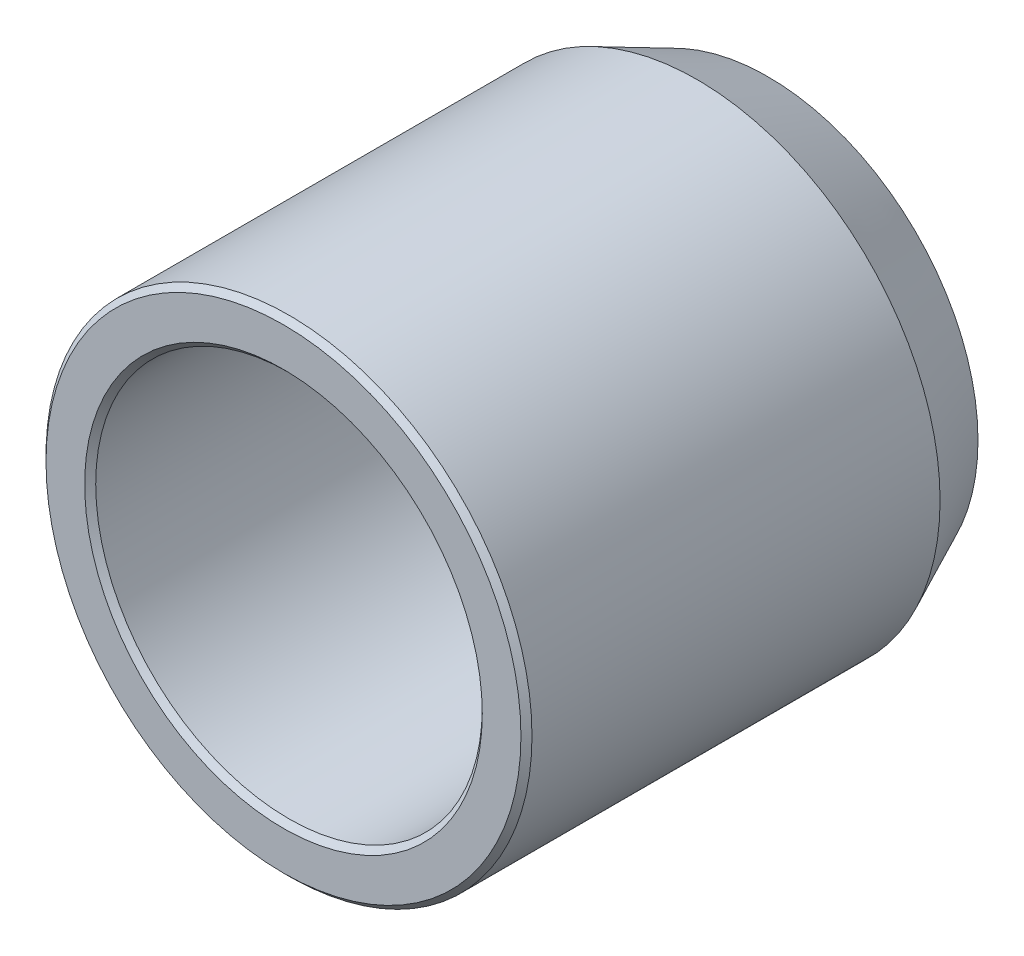
ISO-10303-21;
HEADER;
FILE_DESCRIPTION(('STEP AP214'),'2;1');
FILE_NAME('part.step','',(''),(''),'','','');
FILE_SCHEMA(('AUTOMOTIVE_DESIGN { 1 0 10303 214 1 1 1 1 }'));
ENDSEC;
DATA;
#1=APPLICATION_CONTEXT('core data for automotive mechanical design processes');
#2=APPLICATION_PROTOCOL_DEFINITION('international standard','automotive_design',2000,#1);
#3=PRODUCT_CONTEXT('',#1,'mechanical');
#4=PRODUCT('Part','Part','',(#3));
#5=PRODUCT_RELATED_PRODUCT_CATEGORY('part','',(#4));
#6=PRODUCT_DEFINITION_FORMATION('','',#4);
#7=PRODUCT_DEFINITION_CONTEXT('part definition',#1,'design');
#8=PRODUCT_DEFINITION('design','',#6,#7);
#9=PRODUCT_DEFINITION_SHAPE('','',#8);
#10=(LENGTH_UNIT() NAMED_UNIT(*) SI_UNIT(.MILLI.,.METRE.));
#11=(NAMED_UNIT(*) PLANE_ANGLE_UNIT() SI_UNIT($,.RADIAN.));
#12=(NAMED_UNIT(*) SI_UNIT($,.STERADIAN.) SOLID_ANGLE_UNIT());
#13=UNCERTAINTY_MEASURE_WITH_UNIT(LENGTH_MEASURE(1.E-05),#10,'distance_accuracy_value','');
#14=(GEOMETRIC_REPRESENTATION_CONTEXT(3) GLOBAL_UNCERTAINTY_ASSIGNED_CONTEXT((#13)) GLOBAL_UNIT_ASSIGNED_CONTEXT((#10,
#11,#12)) REPRESENTATION_CONTEXT('',''));
#15=CARTESIAN_POINT('',(0.,0.,0.));
#16=DIRECTION('',(0.,0.,1.));
#17=DIRECTION('',(1.,0.,0.));
#18=AXIS2_PLACEMENT_3D('',#15,#16,#17);
#19=CARTESIAN_POINT('',(0.,17.5,-38.88));
#20=DIRECTION('',(0.,0.,-1.));
#21=DIRECTION('',(-1.,0.,0.));
#22=AXIS2_PLACEMENT_3D('',#19,#20,#21);
#23=PLANE('',#22);
#24=CARTESIAN_POINT('',(0.,0.,-38.88));
#25=DIRECTION('',(0.,0.,1.));
#26=DIRECTION('',(1.,0.,0.));
#27=AXIS2_PLACEMENT_3D('',#24,#25,#26);
#28=CIRCLE('',#27,16.5);
#29=CARTESIAN_POINT('',(16.5,0.,-38.88));
#30=VERTEX_POINT('',#29);
#31=EDGE_CURVE('E10',#30,#30,#28,.T.);
#32=ORIENTED_EDGE('',*,*,#31,.F.);
#33=EDGE_LOOP('',(#32));
#34=FACE_BOUND('',#33,.T.);
#35=CARTESIAN_POINT('',(0.,0.,-38.88));
#36=DIRECTION('',(0.,0.,1.));
#37=DIRECTION('',(1.,0.,0.));
#38=AXIS2_PLACEMENT_3D('',#35,#36,#37);
#39=CIRCLE('',#38,17.5);
#40=CARTESIAN_POINT('',(17.5,0.,-38.88));
#41=VERTEX_POINT('',#40);
#42=EDGE_CURVE('E64',#41,#41,#39,.T.);
#43=ORIENTED_EDGE('',*,*,#42,.T.);
#44=EDGE_LOOP('',(#43));
#45=FACE_BOUND('',#44,.T.);
#46=ADVANCED_FACE('F30',(#34,#45),#23,.F.);
#47=CARTESIAN_POINT('',(0.,0.,-38.88));
#48=DIRECTION('',(0.,0.,1.));
#49=DIRECTION('',(1.,0.,0.));
#50=AXIS2_PLACEMENT_3D('',#47,#48,#49);
#51=CONICAL_SURFACE('',#50,16.5,0.785398163397448);
#52=CARTESIAN_POINT('',(0.,0.,-39.38));
#53=DIRECTION('',(0.,0.,1.));
#54=DIRECTION('',(1.,0.,0.));
#55=AXIS2_PLACEMENT_3D('',#52,#53,#54);
#56=CIRCLE('',#55,16.);
#57=CARTESIAN_POINT('',(16.,0.,-39.38));
#58=VERTEX_POINT('',#57);
#59=EDGE_CURVE('E36',#58,#58,#56,.T.);
#60=ORIENTED_EDGE('',*,*,#59,.F.);
#61=EDGE_LOOP('',(#60));
#62=FACE_BOUND('',#61,.T.);
#63=ORIENTED_EDGE('',*,*,#31,.T.);
#64=EDGE_LOOP('',(#63));
#65=FACE_BOUND('',#64,.T.);
#66=ADVANCED_FACE('F113',(#62,#65),#51,.F.);
#67=CARTESIAN_POINT('',(0.,0.,0.));
#68=DIRECTION('',(0.,0.,1.));
#69=DIRECTION('',(1.,0.,0.));
#70=AXIS2_PLACEMENT_3D('',#67,#68,#69);
#71=CYLINDRICAL_SURFACE('',#70,16.);
#72=CARTESIAN_POINT('',(0.,0.,-43.88));
#73=DIRECTION('',(0.,0.,1.));
#74=DIRECTION('',(1.,0.,0.));
#75=AXIS2_PLACEMENT_3D('',#72,#73,#74);
#76=CIRCLE('',#75,16.);
#77=CARTESIAN_POINT('',(16.,0.,-43.88));
#78=VERTEX_POINT('',#77);
#79=EDGE_CURVE('E40',#78,#78,#76,.T.);
#80=ORIENTED_EDGE('',*,*,#79,.F.);
#81=EDGE_LOOP('',(#80));
#82=FACE_BOUND('',#81,.T.);
#83=ORIENTED_EDGE('',*,*,#59,.T.);
#84=EDGE_LOOP('',(#83));
#85=FACE_BOUND('',#84,.T.);
#86=ADVANCED_FACE('F108',(#82,#85),#71,.F.);
#87=CARTESIAN_POINT('',(0.,16.,-43.88));
#88=DIRECTION('',(0.,0.,1.));
#89=DIRECTION('',(1.,0.,0.));
#90=AXIS2_PLACEMENT_3D('',#87,#88,#89);
#91=PLANE('',#90);
#92=CARTESIAN_POINT('',(0.,0.,-43.88));
#93=DIRECTION('',(0.,0.,1.));
#94=DIRECTION('',(1.,0.,0.));
#95=AXIS2_PLACEMENT_3D('',#92,#93,#94);
#96=CIRCLE('',#95,19.);
#97=CARTESIAN_POINT('',(19.,0.,-43.88));
#98=VERTEX_POINT('',#97);
#99=EDGE_CURVE('E44',#98,#98,#96,.T.);
#100=ORIENTED_EDGE('',*,*,#99,.F.);
#101=EDGE_LOOP('',(#100));
#102=FACE_BOUND('',#101,.T.);
#103=ORIENTED_EDGE('',*,*,#79,.T.);
#104=EDGE_LOOP('',(#103));
#105=FACE_BOUND('',#104,.T.);
#106=ADVANCED_FACE('F102',(#102,#105),#91,.F.);
#107=CARTESIAN_POINT('',(0.,0.,-43.88));
#108=DIRECTION('',(0.,0.,1.));
#109=DIRECTION('',(1.,0.,0.));
#110=AXIS2_PLACEMENT_3D('',#107,#108,#109);
#111=CONICAL_SURFACE('',#110,19.,0.436332312998587);
#112=CARTESIAN_POINT('',(0.,0.,-37.4464792384714));
#113=DIRECTION('',(0.,0.,1.));
#114=DIRECTION('',(1.,0.,0.));
#115=AXIS2_PLACEMENT_3D('',#112,#113,#114);
#116=CIRCLE('',#115,22.);
#117=CARTESIAN_POINT('',(22.,0.,-37.4464792384714));
#118=VERTEX_POINT('',#117);
#119=EDGE_CURVE('E49',#118,#118,#116,.T.);
#120=ORIENTED_EDGE('',*,*,#119,.F.);
#121=EDGE_LOOP('',(#120));
#122=FACE_BOUND('',#121,.T.);
#123=ORIENTED_EDGE('',*,*,#99,.T.);
#124=EDGE_LOOP('',(#123));
#125=FACE_BOUND('',#124,.T.);
#126=ADVANCED_FACE('F96',(#122,#125),#111,.T.);
#127=CARTESIAN_POINT('',(0.,0.,0.));
#128=DIRECTION('',(0.,0.,1.));
#129=DIRECTION('',(1.,0.,0.));
#130=AXIS2_PLACEMENT_3D('',#127,#128,#129);
#131=CYLINDRICAL_SURFACE('',#130,22.);
#132=CARTESIAN_POINT('',(0.,0.,-0.499999999999999));
#133=DIRECTION('',(0.,0.,1.));
#134=DIRECTION('',(1.,0.,0.));
#135=AXIS2_PLACEMENT_3D('',#132,#133,#134);
#136=CIRCLE('',#135,22.);
#137=CARTESIAN_POINT('',(22.,0.,-0.499999999999999));
#138=VERTEX_POINT('',#137);
#139=EDGE_CURVE('E52',#138,#138,#136,.T.);
#140=ORIENTED_EDGE('',*,*,#139,.F.);
#141=EDGE_LOOP('',(#140));
#142=FACE_BOUND('',#141,.T.);
#143=ORIENTED_EDGE('',*,*,#119,.T.);
#144=EDGE_LOOP('',(#143));
#145=FACE_BOUND('',#144,.T.);
#146=ADVANCED_FACE('F90',(#142,#145),#131,.T.);
#147=CARTESIAN_POINT('',(0.,0.,-0.499999999999999));
#148=DIRECTION('',(0.,0.,-1.));
#149=DIRECTION('',(-1.,0.,0.));
#150=AXIS2_PLACEMENT_3D('',#147,#148,#149);
#151=CONICAL_SURFACE('',#150,22.,0.785398163397449);
#152=CARTESIAN_POINT('',(0.,0.,0.));
#153=DIRECTION('',(0.,0.,1.));
#154=DIRECTION('',(1.,0.,0.));
#155=AXIS2_PLACEMENT_3D('',#152,#153,#154);
#156=CIRCLE('',#155,21.5);
#157=CARTESIAN_POINT('',(21.5,0.,0.));
#158=VERTEX_POINT('',#157);
#159=EDGE_CURVE('E55',#158,#158,#156,.T.);
#160=ORIENTED_EDGE('',*,*,#159,.F.);
#161=EDGE_LOOP('',(#160));
#162=FACE_BOUND('',#161,.T.);
#163=ORIENTED_EDGE('',*,*,#139,.T.);
#164=EDGE_LOOP('',(#163));
#165=FACE_BOUND('',#164,.T.);
#166=ADVANCED_FACE('F84',(#162,#165),#151,.T.);
#167=CARTESIAN_POINT('',(0.,18.,0.));
#168=DIRECTION('',(0.,0.,-1.));
#169=DIRECTION('',(-1.,0.,0.));
#170=AXIS2_PLACEMENT_3D('',#167,#168,#169);
#171=PLANE('',#170);
#172=CARTESIAN_POINT('',(0.,0.,0.));
#173=DIRECTION('',(0.,0.,1.));
#174=DIRECTION('',(1.,0.,0.));
#175=AXIS2_PLACEMENT_3D('',#172,#173,#174);
#176=CIRCLE('',#175,18.);
#177=CARTESIAN_POINT('',(18.,0.,0.));
#178=VERTEX_POINT('',#177);
#179=EDGE_CURVE('E58',#178,#178,#176,.T.);
#180=ORIENTED_EDGE('',*,*,#179,.F.);
#181=EDGE_LOOP('',(#180));
#182=FACE_BOUND('',#181,.T.);
#183=ORIENTED_EDGE('',*,*,#159,.T.);
#184=EDGE_LOOP('',(#183));
#185=FACE_BOUND('',#184,.T.);
#186=ADVANCED_FACE('F78',(#182,#185),#171,.F.);
#187=CARTESIAN_POINT('',(0.,0.,0.));
#188=DIRECTION('',(0.,0.,1.));
#189=DIRECTION('',(1.,0.,0.));
#190=AXIS2_PLACEMENT_3D('',#187,#188,#189);
#191=CONICAL_SURFACE('',#190,18.,0.785398163397449);
#192=CARTESIAN_POINT('',(0.,0.,-0.5));
#193=DIRECTION('',(0.,0.,1.));
#194=DIRECTION('',(1.,0.,0.));
#195=AXIS2_PLACEMENT_3D('',#192,#193,#194);
#196=CIRCLE('',#195,17.5);
#197=CARTESIAN_POINT('',(17.5,0.,-0.5));
#198=VERTEX_POINT('',#197);
#199=EDGE_CURVE('E61',#198,#198,#196,.T.);
#200=ORIENTED_EDGE('',*,*,#199,.F.);
#201=EDGE_LOOP('',(#200));
#202=FACE_BOUND('',#201,.T.);
#203=ORIENTED_EDGE('',*,*,#179,.T.);
#204=EDGE_LOOP('',(#203));
#205=FACE_BOUND('',#204,.T.);
#206=ADVANCED_FACE('F72',(#202,#205),#191,.F.);
#207=CARTESIAN_POINT('',(0.,0.,0.));
#208=DIRECTION('',(0.,0.,1.));
#209=DIRECTION('',(1.,0.,0.));
#210=AXIS2_PLACEMENT_3D('',#207,#208,#209);
#211=CYLINDRICAL_SURFACE('',#210,17.5);
#212=ORIENTED_EDGE('',*,*,#42,.F.);
#213=EDGE_LOOP('',(#212));
#214=FACE_BOUND('',#213,.T.);
#215=ORIENTED_EDGE('',*,*,#199,.T.);
#216=EDGE_LOOP('',(#215));
#217=FACE_BOUND('',#216,.T.);
#218=ADVANCED_FACE('F69',(#214,#217),#211,.F.);
#219=CLOSED_SHELL('',(#46,#66,#86,#106,#126,#146,#166,#186,#206,#218));
#220=MANIFOLD_SOLID_BREP('B2',#219);
#221=ADVANCED_BREP_SHAPE_REPRESENTATION('',(#18,#220),#14);
#222=SHAPE_DEFINITION_REPRESENTATION(#9,#221);
ENDSEC;
END-ISO-10303-21;
